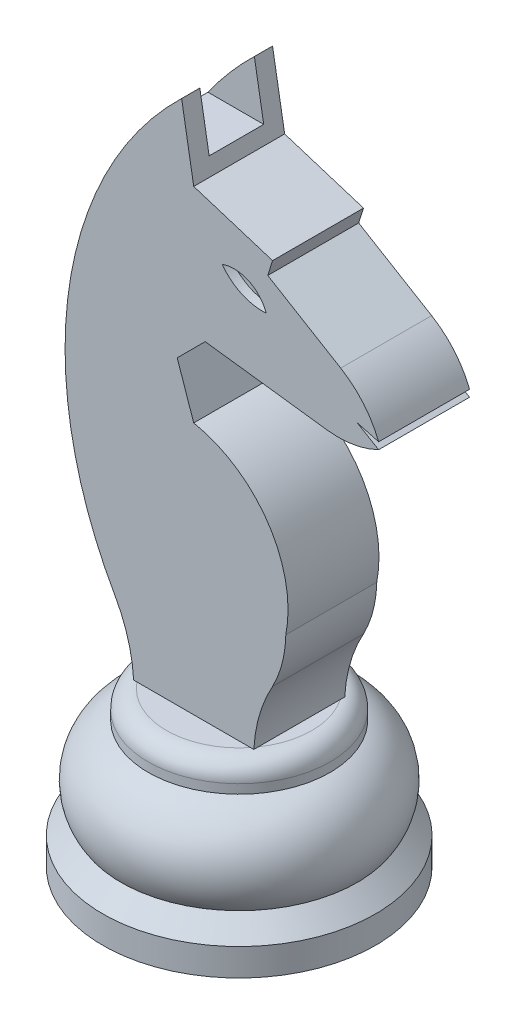
ISO-10303-21;
HEADER;
FILE_DESCRIPTION(('STEP AP214'),'2;1');
FILE_NAME('part.step','',(''),(''),'','','');
FILE_SCHEMA(('AUTOMOTIVE_DESIGN { 1 0 10303 214 1 1 1 1 }'));
ENDSEC;
DATA;
#1=APPLICATION_CONTEXT('core data for automotive mechanical design processes');
#2=APPLICATION_PROTOCOL_DEFINITION('international standard','automotive_design',2000,#1);
#3=PRODUCT_CONTEXT('',#1,'mechanical');
#4=PRODUCT('Part','Part','',(#3));
#5=PRODUCT_RELATED_PRODUCT_CATEGORY('part','',(#4));
#6=PRODUCT_DEFINITION_FORMATION('','',#4);
#7=PRODUCT_DEFINITION_CONTEXT('part definition',#1,'design');
#8=PRODUCT_DEFINITION('design','',#6,#7);
#9=PRODUCT_DEFINITION_SHAPE('','',#8);
#10=(LENGTH_UNIT() NAMED_UNIT(*) SI_UNIT(.MILLI.,.METRE.));
#11=(NAMED_UNIT(*) PLANE_ANGLE_UNIT() SI_UNIT($,.RADIAN.));
#12=(NAMED_UNIT(*) SI_UNIT($,.STERADIAN.) SOLID_ANGLE_UNIT());
#13=UNCERTAINTY_MEASURE_WITH_UNIT(LENGTH_MEASURE(1.E-05),#10,'distance_accuracy_value','');
#14=(GEOMETRIC_REPRESENTATION_CONTEXT(3) GLOBAL_UNCERTAINTY_ASSIGNED_CONTEXT((#13)) GLOBAL_UNIT_ASSIGNED_CONTEXT((#10,
#11,#12)) REPRESENTATION_CONTEXT('',''));
#15=CARTESIAN_POINT('',(0.,0.,0.));
#16=DIRECTION('',(0.,0.,1.));
#17=DIRECTION('',(1.,0.,0.));
#18=AXIS2_PLACEMENT_3D('',#15,#16,#17);
#19=CARTESIAN_POINT('',(4.43651571103369,57.8901281671825,-15.));
#20=DIRECTION('',(0.,0.,1.));
#21=DIRECTION('',(1.,0.,0.));
#22=AXIS2_PLACEMENT_3D('',#19,#20,#21);
#23=CYLINDRICAL_SURFACE('',#22,3.78177275041016);
#24=DIRECTION('',(0.,0.,1.));
#25=VECTOR('',#24,1.);
#26=CARTESIAN_POINT('',(3.12368994317213,61.4367171818533,-15.));
#27=LINE('',#26,#25);
#28=CARTESIAN_POINT('',(3.12368994317213,61.4367171818533,4.));
#29=VERTEX_POINT('',#28);
#30=CARTESIAN_POINT('',(3.12368994317213,61.4367171818533,5.));
#31=VERTEX_POINT('',#30);
#32=EDGE_CURVE('E231',#29,#31,#27,.T.);
#33=ORIENTED_EDGE('',*,*,#32,.F.);
#34=CARTESIAN_POINT('',(4.43651571103369,57.8901281671825,4.));
#35=DIRECTION('',(0.,0.,1.));
#36=DIRECTION('',(-1.,0.,0.));
#37=AXIS2_PLACEMENT_3D('',#34,#35,#36);
#38=CIRCLE('',#37,3.78177275041016);
#39=CARTESIAN_POINT('',(7.98310472570447,59.2029539350441,4.));
#40=VERTEX_POINT('',#39);
#41=EDGE_CURVE('E230',#40,#29,#38,.T.);
#42=ORIENTED_EDGE('',*,*,#41,.F.);
#43=DIRECTION('',(0.,0.,1.));
#44=VECTOR('',#43,1.);
#45=CARTESIAN_POINT('',(7.98310472570447,59.2029539350441,-15.));
#46=LINE('',#45,#44);
#47=CARTESIAN_POINT('',(7.98310472570447,59.2029539350441,5.));
#48=VERTEX_POINT('',#47);
#49=EDGE_CURVE('E218',#40,#48,#46,.T.);
#50=ORIENTED_EDGE('',*,*,#49,.T.);
#51=CARTESIAN_POINT('',(4.43651571103369,57.8901281671825,5.));
#52=DIRECTION('',(0.,0.,1.));
#53=DIRECTION('',(1.,0.,0.));
#54=AXIS2_PLACEMENT_3D('',#51,#52,#53);
#55=CIRCLE('',#54,3.78177275041016);
#56=EDGE_CURVE('E244',#31,#48,#55,.F.);
#57=ORIENTED_EDGE('',*,*,#56,.F.);
#58=EDGE_LOOP('',(#33,#42,#50,#57));
#59=FACE_BOUND('',#58,.T.);
#60=ADVANCED_FACE('F35',(#59),#23,.F.);
#61=CARTESIAN_POINT('',(7.57198155288518,64.7111415775261,-15.));
#62=DIRECTION('',(0.,0.,1.));
#63=DIRECTION('',(1.,0.,0.));
#64=AXIS2_PLACEMENT_3D('',#61,#62,#63);
#65=CYLINDRICAL_SURFACE('',#64,5.52350915342962);
#66=CARTESIAN_POINT('',(7.57198155288518,64.7111415775261,4.));
#67=DIRECTION('',(0.,0.,1.));
#68=DIRECTION('',(1.,0.,0.));
#69=AXIS2_PLACEMENT_3D('',#66,#67,#68);
#70=CIRCLE('',#69,5.52350915342962);
#71=EDGE_CURVE('E50',#29,#40,#70,.T.);
#72=ORIENTED_EDGE('',*,*,#71,.F.);
#73=ORIENTED_EDGE('',*,*,#32,.T.);
#74=CARTESIAN_POINT('',(7.57198155288518,64.7111415775261,5.));
#75=DIRECTION('',(0.,0.,1.));
#76=DIRECTION('',(1.,0.,0.));
#77=AXIS2_PLACEMENT_3D('',#74,#75,#76);
#78=CIRCLE('',#77,5.52350915342962);
#79=EDGE_CURVE('E222',#31,#48,#78,.T.);
#80=ORIENTED_EDGE('',*,*,#79,.T.);
#81=ORIENTED_EDGE('',*,*,#49,.F.);
#82=EDGE_LOOP('',(#72,#73,#80,#81));
#83=FACE_BOUND('',#82,.T.);
#84=ADVANCED_FACE('F220',(#83),#65,.F.);
#85=CARTESIAN_POINT('',(0.,0.,5.));
#86=DIRECTION('',(0.,0.,1.));
#87=DIRECTION('',(1.,0.,0.));
#88=AXIS2_PLACEMENT_3D('',#85,#86,#87);
#89=PLANE('',#88);
#90=DIRECTION('',(-0.991958942438049,0.126560090538789,0.));
#91=VECTOR('',#90,1.);
#92=CARTESIAN_POINT('',(6.69102156361822,52.4432200215809,5.));
#93=LINE('',#92,#91);
#94=CARTESIAN_POINT('',(14.6435990620269,51.4285823333096,5.));
#95=VERTEX_POINT('',#94);
#96=CARTESIAN_POINT('',(1.26040929507154,53.1360902110456,5.));
#97=VERTEX_POINT('',#96);
#98=EDGE_CURVE('E272',#95,#97,#93,.T.);
#99=ORIENTED_EDGE('',*,*,#98,.F.);
#100=CARTESIAN_POINT('',(15.9091999674148,61.3481717576901,5.));
#101=DIRECTION('',(0.,0.,1.));
#102=DIRECTION('',(1.,0.,0.));
#103=AXIS2_PLACEMENT_3D('',#100,#101,#102);
#104=CIRCLE('',#103,10.);
#105=CARTESIAN_POINT('',(20.3370279191774,52.3818826908805,5.));
#106=VERTEX_POINT('',#105);
#107=EDGE_CURVE('E433',#95,#106,#104,.T.);
#108=ORIENTED_EDGE('',*,*,#107,.T.);
#109=DIRECTION('',(-0.860824825124641,0.50890138578032,0.));
#110=VECTOR('',#109,1.);
#111=CARTESIAN_POINT('',(28.2140865617877,47.725132627339,5.));
#112=LINE('',#111,#110);
#113=CARTESIAN_POINT('',(17.9833626558282,53.7733196931858,5.));
#114=VERTEX_POINT('',#113);
#115=EDGE_CURVE('E274',#106,#114,#112,.T.);
#116=ORIENTED_EDGE('',*,*,#115,.T.);
#117=DIRECTION('',(0.965249291729238,-0.261330834032657,0.));
#118=VECTOR('',#117,1.);
#119=CARTESIAN_POINT('',(14.7924400198933,54.6372275778408,5.));
#120=LINE('',#119,#118);
#121=CARTESIAN_POINT('',(20.3370279191774,53.1360902110456,5.));
#122=VERTEX_POINT('',#121);
#123=EDGE_CURVE('E276',#114,#122,#120,.T.);
#124=ORIENTED_EDGE('',*,*,#123,.T.);
#125=CARTESIAN_POINT('',(11.0241641971547,49.4932109521303,5.));
#126=DIRECTION('',(0.,0.,1.));
#127=DIRECTION('',(1.,0.,0.));
#128=AXIS2_PLACEMENT_3D('',#125,#126,#127);
#129=CIRCLE('',#128,10.);
#130=CARTESIAN_POINT('',(16.1651834933892,58.0705019344712,5.));
#131=VERTEX_POINT('',#130);
#132=EDGE_CURVE('E427',#122,#131,#129,.T.);
#133=ORIENTED_EDGE('',*,*,#132,.T.);
#134=DIRECTION('',(0.85772909823408,-0.514101929623448,0.));
#135=VECTOR('',#134,1.);
#136=CARTESIAN_POINT('',(29.8792500799647,49.8506244584026,5.));
#137=LINE('',#136,#135);
#138=CARTESIAN_POINT('',(8.14100346020761,62.88,5.));
#139=VERTEX_POINT('',#138);
#140=EDGE_CURVE('E278',#139,#131,#137,.T.);
#141=ORIENTED_EDGE('',*,*,#140,.F.);
#142=DIRECTION('',(-0.300341483027029,-0.953831742800126,0.));
#143=VECTOR('',#142,1.);
#144=CARTESIAN_POINT('',(-10.606918912442,3.33989488246443,5.));
#145=LINE('',#144,#143);
#146=CARTESIAN_POINT('',(8.67,64.56,5.));
#147=VERTEX_POINT('',#146);
#148=EDGE_CURVE('E281',#147,#139,#145,.T.);
#149=ORIENTED_EDGE('',*,*,#148,.F.);
#150=DIRECTION('',(0.953831742800126,-0.300341483027029,0.));
#151=VECTOR('',#150,1.);
#152=CARTESIAN_POINT('',(19.276918912442,61.2201051175356,5.));
#153=LINE('',#152,#151);
#154=CARTESIAN_POINT('',(0.,67.29,5.));
#155=VERTEX_POINT('',#154);
#156=EDGE_CURVE('E284',#155,#147,#153,.T.);
#157=ORIENTED_EDGE('',*,*,#156,.F.);
#158=DIRECTION('',(-0.169992518725547,0.985445352912755,0.));
#159=VECTOR('',#158,1.);
#160=CARTESIAN_POINT('',(11.272308937644,1.94450984268048,5.));
#161=LINE('',#160,#159);
#162=CARTESIAN_POINT('',(-1.33,75.,5.));
#163=VERTEX_POINT('',#162);
#164=EDGE_CURVE('E287',#155,#163,#161,.T.);
#165=ORIENTED_EDGE('',*,*,#164,.T.);
#166=CARTESIAN_POINT('',(27.9235426116549,44.765662820758,5.));
#167=DIRECTION('',(0.,0.,1.));
#168=DIRECTION('',(1.,0.,0.));
#169=AXIS2_PLACEMENT_3D('',#166,#167,#168);
#170=CIRCLE('',#169,42.07);
#171=CARTESIAN_POINT('',(-8.67,24.01,5.));
#172=VERTEX_POINT('',#171);
#173=EDGE_CURVE('E289',#172,#163,#170,.F.);
#174=ORIENTED_EDGE('',*,*,#173,.F.);
#175=CARTESIAN_POINT('',(-22.6660755194939,16.0931654019663,5.));
#176=DIRECTION('',(0.,0.,1.));
#177=DIRECTION('',(1.,0.,0.));
#178=AXIS2_PLACEMENT_3D('',#175,#176,#177);
#179=CIRCLE('',#178,16.08);
#180=CARTESIAN_POINT('',(-6.61,16.97,5.));
#181=VERTEX_POINT('',#180);
#182=EDGE_CURVE('E292',#181,#172,#179,.T.);
#183=ORIENTED_EDGE('',*,*,#182,.F.);
#184=DIRECTION('',(1.,0.,0.));
#185=VECTOR('',#184,1.);
#186=CARTESIAN_POINT('',(0.,16.97,5.));
#187=LINE('',#186,#185);
#188=CARTESIAN_POINT('',(-6.2449979983984,16.97,5.));
#189=VERTEX_POINT('',#188);
#190=EDGE_CURVE('E296',#181,#189,#187,.T.);
#191=ORIENTED_EDGE('',*,*,#190,.T.);
#192=DIRECTION('',(-1.,0.,0.));
#193=VECTOR('',#192,1.);
#194=CARTESIAN_POINT('',(0.,16.97,5.));
#195=LINE('',#194,#193);
#196=CARTESIAN_POINT('',(6.2449979983984,16.97,5.));
#197=VERTEX_POINT('',#196);
#198=EDGE_CURVE('E408',#197,#189,#195,.T.);
#199=ORIENTED_EDGE('',*,*,#198,.F.);
#200=CARTESIAN_POINT('',(6.61,16.97,5.));
#201=VERTEX_POINT('',#200);
#202=EDGE_CURVE('E295',#197,#201,#187,.T.);
#203=ORIENTED_EDGE('',*,*,#202,.T.);
#204=CARTESIAN_POINT('',(22.6660755194939,16.0931654019663,5.));
#205=DIRECTION('',(0.,0.,1.));
#206=DIRECTION('',(1.,0.,0.));
#207=AXIS2_PLACEMENT_3D('',#204,#205,#206);
#208=CIRCLE('',#207,16.08);
#209=CARTESIAN_POINT('',(8.67,24.01,5.));
#210=VERTEX_POINT('',#209);
#211=EDGE_CURVE('E299',#201,#210,#208,.F.);
#212=ORIENTED_EDGE('',*,*,#211,.T.);
#213=CARTESIAN_POINT('',(-2.54706769196138,29.9226806436638,5.));
#214=DIRECTION('',(0.,0.,1.));
#215=DIRECTION('',(1.,0.,0.));
#216=AXIS2_PLACEMENT_3D('',#213,#214,#215);
#217=CIRCLE('',#216,12.68);
#218=CARTESIAN_POINT('',(10.13,29.65,5.));
#219=VERTEX_POINT('',#218);
#220=EDGE_CURVE('E301',#210,#219,#217,.T.);
#221=ORIENTED_EDGE('',*,*,#220,.T.);
#222=CARTESIAN_POINT('',(-2.49283141037903,32.142831410379,5.));
#223=DIRECTION('',(0.,0.,1.));
#224=DIRECTION('',(1.,0.,0.));
#225=AXIS2_PLACEMENT_3D('',#222,#223,#224);
#226=CIRCLE('',#225,12.8666266463057);
#227=CARTESIAN_POINT('',(0.,44.765662820758,5.));
#228=VERTEX_POINT('',#227);
#229=EDGE_CURVE('E262',#228,#219,#226,.F.);
#230=ORIENTED_EDGE('',*,*,#229,.F.);
#231=DIRECTION('',(0.32451587239111,-0.945880250648166,0.));
#232=VECTOR('',#231,1.);
#233=CARTESIAN_POINT('',(13.7409614258118,4.71429663695194,5.));
#234=LINE('',#233,#232);
#235=CARTESIAN_POINT('',(-1.81621596842221,50.0594649475518,5.));
#236=VERTEX_POINT('',#235);
#237=EDGE_CURVE('E265',#236,#228,#234,.T.);
#238=ORIENTED_EDGE('',*,*,#237,.F.);
#239=DIRECTION('',(-0.707106781186542,-0.707106781186553,0.));
#240=VECTOR('',#239,1.);
#241=CARTESIAN_POINT('',(-25.937840457987,25.9378404579866,5.));
#242=LINE('',#241,#240);
#243=EDGE_CURVE('E269',#97,#236,#242,.T.);
#244=ORIENTED_EDGE('',*,*,#243,.F.);
#245=EDGE_LOOP('',(#99,#108,#116,#124,#133,#141,#149,#157,#165,#174,#183,#191,#199,#203,#212,
#221,#230,#238,#244));
#246=FACE_BOUND('',#245,.T.);
#247=ORIENTED_EDGE('',*,*,#79,.F.);
#248=ORIENTED_EDGE('',*,*,#56,.T.);
#249=EDGE_LOOP('',(#247,#248));
#250=FACE_BOUND('',#249,.T.);
#251=ADVANCED_FACE('F458',(#246,#250),#89,.T.);
#252=CARTESIAN_POINT('',(0.,0.,-5.));
#253=DIRECTION('',(0.,0.,1.));
#254=DIRECTION('',(1.,0.,0.));
#255=AXIS2_PLACEMENT_3D('',#252,#253,#254);
#256=PLANE('',#255);
#257=DIRECTION('',(-0.860824825124641,0.50890138578032,0.));
#258=VECTOR('',#257,1.);
#259=CARTESIAN_POINT('',(28.2140865617877,47.725132627339,-5.));
#260=LINE('',#259,#258);
#261=CARTESIAN_POINT('',(20.3370279191774,52.3818826908805,-5.));
#262=VERTEX_POINT('',#261);
#263=CARTESIAN_POINT('',(17.9833626558282,53.7733196931858,-5.));
#264=VERTEX_POINT('',#263);
#265=EDGE_CURVE('E314',#262,#264,#260,.T.);
#266=ORIENTED_EDGE('',*,*,#265,.F.);
#267=CARTESIAN_POINT('',(15.9091999674148,61.3481717576901,-5.));
#268=DIRECTION('',(0.,0.,1.));
#269=DIRECTION('',(1.,0.,0.));
#270=AXIS2_PLACEMENT_3D('',#267,#268,#269);
#271=CIRCLE('',#270,10.);
#272=CARTESIAN_POINT('',(14.6435990620269,51.4285823333096,-5.));
#273=VERTEX_POINT('',#272);
#274=EDGE_CURVE('E429',#262,#273,#271,.F.);
#275=ORIENTED_EDGE('',*,*,#274,.T.);
#276=DIRECTION('',(-0.991958942438049,0.126560090538789,0.));
#277=VECTOR('',#276,1.);
#278=CARTESIAN_POINT('',(6.69102156361822,52.4432200215809,-5.));
#279=LINE('',#278,#277);
#280=CARTESIAN_POINT('',(1.26040929507154,53.1360902110456,-5.));
#281=VERTEX_POINT('',#280);
#282=EDGE_CURVE('E312',#273,#281,#279,.T.);
#283=ORIENTED_EDGE('',*,*,#282,.T.);
#284=DIRECTION('',(-0.707106781186542,-0.707106781186553,0.));
#285=VECTOR('',#284,1.);
#286=CARTESIAN_POINT('',(-25.937840457987,25.9378404579866,-5.));
#287=LINE('',#286,#285);
#288=CARTESIAN_POINT('',(-1.81621596842221,50.0594649475518,-5.));
#289=VERTEX_POINT('',#288);
#290=EDGE_CURVE('E309',#281,#289,#287,.T.);
#291=ORIENTED_EDGE('',*,*,#290,.T.);
#292=DIRECTION('',(0.32451587239111,-0.945880250648166,0.));
#293=VECTOR('',#292,1.);
#294=CARTESIAN_POINT('',(13.7409614258118,4.71429663695194,-5.));
#295=LINE('',#294,#293);
#296=CARTESIAN_POINT('',(0.,44.765662820758,-5.));
#297=VERTEX_POINT('',#296);
#298=EDGE_CURVE('E306',#289,#297,#295,.T.);
#299=ORIENTED_EDGE('',*,*,#298,.T.);
#300=CARTESIAN_POINT('',(-2.49283141037903,32.142831410379,-5.));
#301=DIRECTION('',(0.,0.,1.));
#302=DIRECTION('',(1.,0.,0.));
#303=AXIS2_PLACEMENT_3D('',#300,#301,#302);
#304=CIRCLE('',#303,12.8666266463057);
#305=CARTESIAN_POINT('',(10.13,29.65,-5.));
#306=VERTEX_POINT('',#305);
#307=EDGE_CURVE('E261',#297,#306,#304,.F.);
#308=ORIENTED_EDGE('',*,*,#307,.T.);
#309=CARTESIAN_POINT('',(-2.54706769196138,29.9226806436638,-5.));
#310=DIRECTION('',(0.,0.,1.));
#311=DIRECTION('',(1.,0.,0.));
#312=AXIS2_PLACEMENT_3D('',#309,#310,#311);
#313=CIRCLE('',#312,12.68);
#314=CARTESIAN_POINT('',(8.67,24.01,-5.));
#315=VERTEX_POINT('',#314);
#316=EDGE_CURVE('E266',#315,#306,#313,.T.);
#317=ORIENTED_EDGE('',*,*,#316,.F.);
#318=CARTESIAN_POINT('',(22.6660755194939,16.0931654019663,-5.));
#319=DIRECTION('',(0.,0.,1.));
#320=DIRECTION('',(1.,0.,0.));
#321=AXIS2_PLACEMENT_3D('',#318,#319,#320);
#322=CIRCLE('',#321,16.08);
#323=CARTESIAN_POINT('',(6.61,16.97,-5.));
#324=VERTEX_POINT('',#323);
#325=EDGE_CURVE('E341',#324,#315,#322,.F.);
#326=ORIENTED_EDGE('',*,*,#325,.F.);
#327=DIRECTION('',(1.,0.,0.));
#328=VECTOR('',#327,1.);
#329=CARTESIAN_POINT('',(0.,16.97,-5.));
#330=LINE('',#329,#328);
#331=CARTESIAN_POINT('',(6.2449979983984,16.97,-5.));
#332=VERTEX_POINT('',#331);
#333=EDGE_CURVE('E337',#332,#324,#330,.T.);
#334=ORIENTED_EDGE('',*,*,#333,.F.);
#335=DIRECTION('',(-1.,0.,0.));
#336=VECTOR('',#335,1.);
#337=CARTESIAN_POINT('',(0.,16.97,-5.));
#338=LINE('',#337,#336);
#339=CARTESIAN_POINT('',(-6.2449979983984,16.97,-5.));
#340=VERTEX_POINT('',#339);
#341=EDGE_CURVE('E405',#332,#340,#338,.T.);
#342=ORIENTED_EDGE('',*,*,#341,.T.);
#343=CARTESIAN_POINT('',(-6.61,16.97,-5.));
#344=VERTEX_POINT('',#343);
#345=EDGE_CURVE('E338',#344,#340,#330,.T.);
#346=ORIENTED_EDGE('',*,*,#345,.F.);
#347=CARTESIAN_POINT('',(-22.6660755194939,16.0931654019663,-5.));
#348=DIRECTION('',(0.,0.,1.));
#349=DIRECTION('',(1.,0.,0.));
#350=AXIS2_PLACEMENT_3D('',#347,#348,#349);
#351=CIRCLE('',#350,16.08);
#352=CARTESIAN_POINT('',(-8.67,24.01,-5.));
#353=VERTEX_POINT('',#352);
#354=EDGE_CURVE('E334',#344,#353,#351,.T.);
#355=ORIENTED_EDGE('',*,*,#354,.T.);
#356=CARTESIAN_POINT('',(27.9235426116549,44.765662820758,-5.));
#357=DIRECTION('',(0.,0.,1.));
#358=DIRECTION('',(1.,0.,0.));
#359=AXIS2_PLACEMENT_3D('',#356,#357,#358);
#360=CIRCLE('',#359,42.07);
#361=CARTESIAN_POINT('',(-1.33,75.,-5.));
#362=VERTEX_POINT('',#361);
#363=EDGE_CURVE('E331',#353,#362,#360,.F.);
#364=ORIENTED_EDGE('',*,*,#363,.T.);
#365=DIRECTION('',(-0.169992518725547,0.985445352912755,0.));
#366=VECTOR('',#365,1.);
#367=CARTESIAN_POINT('',(11.272308937644,1.94450984268048,-5.));
#368=LINE('',#367,#366);
#369=CARTESIAN_POINT('',(0.,67.29,-5.));
#370=VERTEX_POINT('',#369);
#371=EDGE_CURVE('E328',#370,#362,#368,.T.);
#372=ORIENTED_EDGE('',*,*,#371,.F.);
#373=DIRECTION('',(0.953831742800126,-0.300341483027029,0.));
#374=VECTOR('',#373,1.);
#375=CARTESIAN_POINT('',(19.276918912442,61.2201051175356,-5.));
#376=LINE('',#375,#374);
#377=CARTESIAN_POINT('',(8.67,64.56,-5.));
#378=VERTEX_POINT('',#377);
#379=EDGE_CURVE('E325',#370,#378,#376,.T.);
#380=ORIENTED_EDGE('',*,*,#379,.T.);
#381=DIRECTION('',(-0.300341483027029,-0.953831742800126,0.));
#382=VECTOR('',#381,1.);
#383=CARTESIAN_POINT('',(-10.606918912442,3.33989488246443,-5.));
#384=LINE('',#383,#382);
#385=CARTESIAN_POINT('',(8.14100346020761,62.88,-5.));
#386=VERTEX_POINT('',#385);
#387=EDGE_CURVE('E322',#378,#386,#384,.T.);
#388=ORIENTED_EDGE('',*,*,#387,.T.);
#389=DIRECTION('',(0.85772909823408,-0.514101929623448,0.));
#390=VECTOR('',#389,1.);
#391=CARTESIAN_POINT('',(29.8792500799647,49.8506244584026,-5.));
#392=LINE('',#391,#390);
#393=CARTESIAN_POINT('',(16.1651834933892,58.0705019344712,-5.));
#394=VERTEX_POINT('',#393);
#395=EDGE_CURVE('E319',#386,#394,#392,.T.);
#396=ORIENTED_EDGE('',*,*,#395,.T.);
#397=CARTESIAN_POINT('',(11.0241641971547,49.4932109521303,-5.));
#398=DIRECTION('',(0.,0.,1.));
#399=DIRECTION('',(1.,0.,0.));
#400=AXIS2_PLACEMENT_3D('',#397,#398,#399);
#401=CIRCLE('',#400,10.);
#402=CARTESIAN_POINT('',(20.3370279191774,53.1360902110456,-5.));
#403=VERTEX_POINT('',#402);
#404=EDGE_CURVE('E425',#394,#403,#401,.F.);
#405=ORIENTED_EDGE('',*,*,#404,.T.);
#406=DIRECTION('',(0.965249291729238,-0.261330834032657,0.));
#407=VECTOR('',#406,1.);
#408=CARTESIAN_POINT('',(14.7924400198933,54.6372275778408,-5.));
#409=LINE('',#408,#407);
#410=EDGE_CURVE('E316',#264,#403,#409,.T.);
#411=ORIENTED_EDGE('',*,*,#410,.F.);
#412=EDGE_LOOP('',(#266,#275,#283,#291,#299,#308,#317,#326,#334,#342,#346,#355,#364,#372,#380,
#388,#396,#405,#411));
#413=FACE_BOUND('',#412,.T.);
#414=CARTESIAN_POINT('',(4.43651571103369,57.8901281671825,-5.));
#415=DIRECTION('',(0.,0.,1.));
#416=DIRECTION('',(1.,0.,0.));
#417=AXIS2_PLACEMENT_3D('',#414,#415,#416);
#418=CIRCLE('',#417,3.78177275041016);
#419=CARTESIAN_POINT('',(3.12368994317213,61.4367171818533,-5.));
#420=VERTEX_POINT('',#419);
#421=CARTESIAN_POINT('',(7.98310472570447,59.2029539350441,-5.));
#422=VERTEX_POINT('',#421);
#423=EDGE_CURVE('E11',#420,#422,#418,.F.);
#424=ORIENTED_EDGE('',*,*,#423,.F.);
#425=CARTESIAN_POINT('',(7.57198155288518,64.7111415775261,-5.));
#426=DIRECTION('',(0.,0.,1.));
#427=DIRECTION('',(1.,0.,0.));
#428=AXIS2_PLACEMENT_3D('',#425,#426,#427);
#429=CIRCLE('',#428,5.52350915342962);
#430=EDGE_CURVE('E43',#420,#422,#429,.T.);
#431=ORIENTED_EDGE('',*,*,#430,.T.);
#432=EDGE_LOOP('',(#424,#431));
#433=FACE_BOUND('',#432,.T.);
#434=ADVANCED_FACE('F437',(#413,#433),#256,.F.);
#435=CARTESIAN_POINT('',(0.,16.97,0.));
#436=DIRECTION('',(0.,-1.,0.));
#437=DIRECTION('',(0.,0.,-1.));
#438=AXIS2_PLACEMENT_3D('',#435,#436,#437);
#439=PLANE('',#438);
#440=DIRECTION('',(0.,0.,-1.));
#441=VECTOR('',#440,1.);
#442=CARTESIAN_POINT('',(6.61,16.97,5.));
#443=LINE('',#442,#441);
#444=CARTESIAN_POINT('',(6.61,16.97,4.50642874125399));
#445=VERTEX_POINT('',#444);
#446=CARTESIAN_POINT('',(6.61,16.97,-4.50642874125399));
#447=VERTEX_POINT('',#446);
#448=EDGE_CURVE('E410',#445,#447,#443,.T.);
#449=ORIENTED_EDGE('',*,*,#448,.F.);
#450=CARTESIAN_POINT('',(0.,16.97,0.));
#451=DIRECTION('',(0.,-1.,0.));
#452=DIRECTION('',(0.,0.,-1.));
#453=AXIS2_PLACEMENT_3D('',#450,#451,#452);
#454=CIRCLE('',#453,8.);
#455=EDGE_CURVE('E390',#447,#445,#454,.T.);
#456=ORIENTED_EDGE('',*,*,#455,.F.);
#457=EDGE_LOOP('',(#449,#456));
#458=FACE_BOUND('',#457,.T.);
#459=ADVANCED_FACE('F500',(#458),#439,.F.);
#460=CARTESIAN_POINT('',(-6.61,16.97,4.50642874125399));
#461=VERTEX_POINT('',#460);
#462=CARTESIAN_POINT('',(-6.61,16.97,-4.50642874125399));
#463=VERTEX_POINT('',#462);
#464=EDGE_CURVE('E863',#461,#463,#454,.T.);
#465=ORIENTED_EDGE('',*,*,#464,.F.);
#466=DIRECTION('',(0.,0.,-1.));
#467=VECTOR('',#466,1.);
#468=CARTESIAN_POINT('',(-6.61,16.97,5.));
#469=LINE('',#468,#467);
#470=EDGE_CURVE('E413',#461,#463,#469,.T.);
#471=ORIENTED_EDGE('',*,*,#470,.T.);
#472=EDGE_LOOP('',(#465,#471));
#473=FACE_BOUND('',#472,.T.);
#474=ADVANCED_FACE('F765',(#473),#439,.F.);
#475=ORIENTED_EDGE('',*,*,#341,.F.);
#476=EDGE_CURVE('E385',#340,#332,#454,.T.);
#477=ORIENTED_EDGE('',*,*,#476,.F.);
#478=EDGE_LOOP('',(#475,#477));
#479=FACE_BOUND('',#478,.T.);
#480=ADVANCED_FACE('F742',(#479),#439,.F.);
#481=CARTESIAN_POINT('',(0.,14.97,0.));
#482=DIRECTION('',(0.,-1.,0.));
#483=DIRECTION('',(0.,0.,-1.));
#484=AXIS2_PLACEMENT_3D('',#481,#482,#483);
#485=TOROIDAL_SURFACE('',#484,7.99999999999999,2.00000000000001);
#486=EDGE_CURVE('E386',#332,#447,#454,.T.);
#487=ORIENTED_EDGE('',*,*,#486,.T.);
#488=ORIENTED_EDGE('',*,*,#455,.T.);
#489=EDGE_CURVE('E841',#445,#197,#454,.T.);
#490=ORIENTED_EDGE('',*,*,#489,.T.);
#491=EDGE_CURVE('E849',#197,#189,#454,.T.);
#492=ORIENTED_EDGE('',*,*,#491,.T.);
#493=EDGE_CURVE('E861',#189,#461,#454,.T.);
#494=ORIENTED_EDGE('',*,*,#493,.T.);
#495=ORIENTED_EDGE('',*,*,#464,.T.);
#496=EDGE_CURVE('E864',#463,#340,#454,.T.);
#497=ORIENTED_EDGE('',*,*,#496,.T.);
#498=ORIENTED_EDGE('',*,*,#476,.T.);
#499=EDGE_LOOP('',(#487,#488,#490,#492,#494,#495,#497,#498));
#500=FACE_BOUND('',#499,.T.);
#501=CARTESIAN_POINT('',(0.,14.97,0.));
#502=DIRECTION('',(0.,-1.,0.));
#503=DIRECTION('',(0.,0.,-1.));
#504=AXIS2_PLACEMENT_3D('',#501,#502,#503);
#505=CIRCLE('',#504,10.);
#506=CARTESIAN_POINT('',(0.,14.97,-10.));
#507=VERTEX_POINT('',#506);
#508=EDGE_CURVE('E402',#507,#507,#505,.T.);
#509=ORIENTED_EDGE('',*,*,#508,.F.);
#510=EDGE_LOOP('',(#509));
#511=FACE_BOUND('',#510,.T.);
#512=ADVANCED_FACE('F749',(#500,#511),#485,.T.);
#513=CARTESIAN_POINT('',(0.,5.,0.));
#514=DIRECTION('',(0.,-1.,0.));
#515=DIRECTION('',(0.,0.,-1.));
#516=AXIS2_PLACEMENT_3D('',#513,#514,#515);
#517=CYLINDRICAL_SURFACE('',#516,10.);
#518=ORIENTED_EDGE('',*,*,#508,.T.);
#519=EDGE_LOOP('',(#518));
#520=FACE_BOUND('',#519,.T.);
#521=CARTESIAN_POINT('',(0.,13.97,0.));
#522=DIRECTION('',(0.,-1.,0.));
#523=DIRECTION('',(0.,0.,-1.));
#524=AXIS2_PLACEMENT_3D('',#521,#522,#523);
#525=CIRCLE('',#524,10.);
#526=CARTESIAN_POINT('',(0.,13.97,-10.));
#527=VERTEX_POINT('',#526);
#528=EDGE_CURVE('E399',#527,#527,#525,.T.);
#529=ORIENTED_EDGE('',*,*,#528,.F.);
#530=EDGE_LOOP('',(#529));
#531=FACE_BOUND('',#530,.T.);
#532=ADVANCED_FACE('F754',(#520,#531),#517,.T.);
#533=CARTESIAN_POINT('',(0.,8.31380661428567,0.));
#534=DIRECTION('',(0.,-1.,0.));
#535=DIRECTION('',(0.,0.,-1.));
#536=AXIS2_PLACEMENT_3D('',#533,#534,#535);
#537=TOROIDAL_SURFACE('',#536,7.99813177671417,6.);
#538=ORIENTED_EDGE('',*,*,#528,.T.);
#539=EDGE_LOOP('',(#538));
#540=FACE_BOUND('',#539,.T.);
#541=CARTESIAN_POINT('',(0.,5.,0.));
#542=DIRECTION('',(0.,-1.,0.));
#543=DIRECTION('',(0.,0.,-1.));
#544=AXIS2_PLACEMENT_3D('',#541,#542,#543);
#545=CIRCLE('',#544,13.);
#546=CARTESIAN_POINT('',(0.,5.,-13.));
#547=VERTEX_POINT('',#546);
#548=EDGE_CURVE('E396',#547,#547,#545,.T.);
#549=ORIENTED_EDGE('',*,*,#548,.F.);
#550=EDGE_LOOP('',(#549));
#551=FACE_BOUND('',#550,.T.);
#552=ADVANCED_FACE('F806',(#540,#551),#537,.T.);
#553=CARTESIAN_POINT('',(0.,5.,0.));
#554=DIRECTION('',(0.,-1.,0.));
#555=DIRECTION('',(0.,0.,-1.));
#556=AXIS2_PLACEMENT_3D('',#553,#554,#555);
#557=CONICAL_SURFACE('',#556,13.,0.785398163397449);
#558=CARTESIAN_POINT('',(0.,3.,0.));
#559=DIRECTION('',(0.,-1.,0.));
#560=DIRECTION('',(0.,0.,-1.));
#561=AXIS2_PLACEMENT_3D('',#558,#559,#560);
#562=CIRCLE('',#561,15.);
#563=CARTESIAN_POINT('',(0.,3.,-15.));
#564=VERTEX_POINT('',#563);
#565=EDGE_CURVE('E393',#564,#564,#562,.T.);
#566=ORIENTED_EDGE('',*,*,#565,.F.);
#567=EDGE_LOOP('',(#566));
#568=FACE_BOUND('',#567,.T.);
#569=ORIENTED_EDGE('',*,*,#548,.T.);
#570=EDGE_LOOP('',(#569));
#571=FACE_BOUND('',#570,.T.);
#572=ADVANCED_FACE('F796',(#568,#571),#557,.T.);
#573=CARTESIAN_POINT('',(0.,5.,0.));
#574=DIRECTION('',(0.,-1.,0.));
#575=DIRECTION('',(0.,0.,-1.));
#576=AXIS2_PLACEMENT_3D('',#573,#574,#575);
#577=CYLINDRICAL_SURFACE('',#576,15.);
#578=CARTESIAN_POINT('',(0.,0.,0.));
#579=DIRECTION('',(0.,-1.,0.));
#580=DIRECTION('',(0.,0.,-1.));
#581=AXIS2_PLACEMENT_3D('',#578,#579,#580);
#582=CIRCLE('',#581,15.);
#583=CARTESIAN_POINT('',(0.,0.,-15.));
#584=VERTEX_POINT('',#583);
#585=EDGE_CURVE('E389',#584,#584,#582,.T.);
#586=ORIENTED_EDGE('',*,*,#585,.F.);
#587=EDGE_LOOP('',(#586));
#588=FACE_BOUND('',#587,.T.);
#589=ORIENTED_EDGE('',*,*,#565,.T.);
#590=EDGE_LOOP('',(#589));
#591=FACE_BOUND('',#590,.T.);
#592=ADVANCED_FACE('F786',(#588,#591),#577,.T.);
#593=CARTESIAN_POINT('',(0.,0.,0.));
#594=DIRECTION('',(0.,-1.,0.));
#595=DIRECTION('',(0.,0.,-1.));
#596=AXIS2_PLACEMENT_3D('',#593,#594,#595);
#597=PLANE('',#596);
#598=ORIENTED_EDGE('',*,*,#585,.T.);
#599=EDGE_LOOP('',(#598));
#600=FACE_BOUND('',#599,.T.);
#601=ADVANCED_FACE('F739',(#600),#597,.T.);
#602=ORIENTED_EDGE('',*,*,#491,.F.);
#603=ORIENTED_EDGE('',*,*,#198,.T.);
#604=EDGE_LOOP('',(#602,#603));
#605=FACE_BOUND('',#604,.T.);
#606=ADVANCED_FACE('F729',(#605),#439,.F.);
#607=CARTESIAN_POINT('',(0.,16.97,5.));
#608=DIRECTION('',(0.,1.,0.));
#609=DIRECTION('',(0.,0.,1.));
#610=AXIS2_PLACEMENT_3D('',#607,#608,#609);
#611=PLANE('',#610);
#612=ORIENTED_EDGE('',*,*,#345,.T.);
#613=ORIENTED_EDGE('',*,*,#496,.F.);
#614=DIRECTION('',(0.,0.,-1.));
#615=VECTOR('',#614,1.);
#616=CARTESIAN_POINT('',(-6.61,16.97,5.));
#617=LINE('',#616,#615);
#618=EDGE_CURVE('E353',#463,#344,#617,.T.);
#619=ORIENTED_EDGE('',*,*,#618,.T.);
#620=EDGE_LOOP('',(#612,#613,#619));
#621=FACE_BOUND('',#620,.T.);
#622=ADVANCED_FACE('F654',(#621),#611,.F.);
#623=EDGE_CURVE('E354',#181,#461,#617,.T.);
#624=ORIENTED_EDGE('',*,*,#623,.T.);
#625=ORIENTED_EDGE('',*,*,#493,.F.);
#626=ORIENTED_EDGE('',*,*,#190,.F.);
#627=EDGE_LOOP('',(#624,#625,#626));
#628=FACE_BOUND('',#627,.T.);
#629=ADVANCED_FACE('F712',(#628),#611,.F.);
#630=ORIENTED_EDGE('',*,*,#202,.F.);
#631=ORIENTED_EDGE('',*,*,#489,.F.);
#632=DIRECTION('',(0.,0.,-1.));
#633=VECTOR('',#632,1.);
#634=CARTESIAN_POINT('',(6.61,16.97,5.));
#635=LINE('',#634,#633);
#636=EDGE_CURVE('E350',#201,#445,#635,.T.);
#637=ORIENTED_EDGE('',*,*,#636,.F.);
#638=EDGE_LOOP('',(#630,#631,#637));
#639=FACE_BOUND('',#638,.T.);
#640=ADVANCED_FACE('F655',(#639),#611,.F.);
#641=CARTESIAN_POINT('',(-2.49283141037903,32.142831410379,5.));
#642=DIRECTION('',(0.,0.,-1.));
#643=DIRECTION('',(-1.,0.,0.));
#644=AXIS2_PLACEMENT_3D('',#641,#642,#643);
#645=CYLINDRICAL_SURFACE('',#644,12.8666266463057);
#646=ORIENTED_EDGE('',*,*,#307,.F.);
#647=DIRECTION('',(0.,0.,-1.));
#648=VECTOR('',#647,1.);
#649=CARTESIAN_POINT('',(0.,44.765662820758,5.));
#650=LINE('',#649,#648);
#651=EDGE_CURVE('E383',#228,#297,#650,.T.);
#652=ORIENTED_EDGE('',*,*,#651,.F.);
#653=ORIENTED_EDGE('',*,*,#229,.T.);
#654=DIRECTION('',(0.,0.,-1.));
#655=VECTOR('',#654,1.);
#656=CARTESIAN_POINT('',(10.13,29.65,5.));
#657=LINE('',#656,#655);
#658=EDGE_CURVE('E303',#219,#306,#657,.T.);
#659=ORIENTED_EDGE('',*,*,#658,.T.);
#660=EDGE_LOOP('',(#646,#652,#653,#659));
#661=FACE_BOUND('',#660,.T.);
#662=ADVANCED_FACE('F693',(#661),#645,.T.);
#663=CARTESIAN_POINT('',(13.7409614258118,4.71429663695194,5.));
#664=DIRECTION('',(0.945880250648166,0.32451587239111,0.));
#665=DIRECTION('',(-0.32451587239111,0.945880250648166,0.));
#666=AXIS2_PLACEMENT_3D('',#663,#664,#665);
#667=PLANE('',#666);
#668=ORIENTED_EDGE('',*,*,#298,.F.);
#669=DIRECTION('',(0.,0.,-1.));
#670=VECTOR('',#669,1.);
#671=CARTESIAN_POINT('',(-1.81621596842221,50.0594649475518,5.));
#672=LINE('',#671,#670);
#673=EDGE_CURVE('E381',#236,#289,#672,.T.);
#674=ORIENTED_EDGE('',*,*,#673,.F.);
#675=ORIENTED_EDGE('',*,*,#237,.T.);
#676=ORIENTED_EDGE('',*,*,#651,.T.);
#677=EDGE_LOOP('',(#668,#674,#675,#676));
#678=FACE_BOUND('',#677,.T.);
#679=ADVANCED_FACE('F683',(#678),#667,.T.);
#680=CARTESIAN_POINT('',(-25.937840457987,25.9378404579866,5.));
#681=DIRECTION('',(0.707106781186553,-0.707106781186542,0.));
#682=DIRECTION('',(0.707106781186542,0.707106781186553,0.));
#683=AXIS2_PLACEMENT_3D('',#680,#681,#682);
#684=PLANE('',#683);
#685=ORIENTED_EDGE('',*,*,#290,.F.);
#686=DIRECTION('',(0.,0.,-1.));
#687=VECTOR('',#686,1.);
#688=CARTESIAN_POINT('',(1.26040929507154,53.1360902110456,5.));
#689=LINE('',#688,#687);
#690=EDGE_CURVE('E378',#97,#281,#689,.T.);
#691=ORIENTED_EDGE('',*,*,#690,.F.);
#692=ORIENTED_EDGE('',*,*,#243,.T.);
#693=ORIENTED_EDGE('',*,*,#673,.T.);
#694=EDGE_LOOP('',(#685,#691,#692,#693));
#695=FACE_BOUND('',#694,.T.);
#696=ADVANCED_FACE('F538',(#695),#684,.T.);
#697=CARTESIAN_POINT('',(6.69102156361822,52.4432200215809,5.));
#698=DIRECTION('',(-0.126560090538789,-0.991958942438049,0.));
#699=DIRECTION('',(0.991958942438049,-0.126560090538789,0.));
#700=AXIS2_PLACEMENT_3D('',#697,#698,#699);
#701=PLANE('',#700);
#702=ORIENTED_EDGE('',*,*,#282,.F.);
#703=DIRECTION('',(0.,0.,1.));
#704=VECTOR('',#703,1.);
#705=CARTESIAN_POINT('',(14.6435990620269,51.4285823333096,5.));
#706=LINE('',#705,#704);
#707=EDGE_CURVE('E431',#273,#95,#706,.T.);
#708=ORIENTED_EDGE('',*,*,#707,.T.);
#709=ORIENTED_EDGE('',*,*,#98,.T.);
#710=ORIENTED_EDGE('',*,*,#690,.T.);
#711=EDGE_LOOP('',(#702,#708,#709,#710));
#712=FACE_BOUND('',#711,.T.);
#713=ADVANCED_FACE('F526',(#712),#701,.T.);
#714=CARTESIAN_POINT('',(28.2140865617877,47.725132627339,5.));
#715=DIRECTION('',(-0.50890138578032,-0.860824825124642,0.));
#716=DIRECTION('',(0.860824825124642,-0.50890138578032,0.));
#717=AXIS2_PLACEMENT_3D('',#714,#715,#716);
#718=PLANE('',#717);
#719=ORIENTED_EDGE('',*,*,#265,.T.);
#720=DIRECTION('',(0.,0.,-1.));
#721=VECTOR('',#720,1.);
#722=CARTESIAN_POINT('',(17.9833626558282,53.7733196931858,5.));
#723=LINE('',#722,#721);
#724=EDGE_CURVE('E372',#114,#264,#723,.T.);
#725=ORIENTED_EDGE('',*,*,#724,.F.);
#726=ORIENTED_EDGE('',*,*,#115,.F.);
#727=DIRECTION('',(0.,0.,-1.));
#728=VECTOR('',#727,1.);
#729=CARTESIAN_POINT('',(20.3370279191774,52.3818826908805,5.));
#730=LINE('',#729,#728);
#731=EDGE_CURVE('E375',#106,#262,#730,.T.);
#732=ORIENTED_EDGE('',*,*,#731,.T.);
#733=EDGE_LOOP('',(#719,#725,#726,#732));
#734=FACE_BOUND('',#733,.T.);
#735=ADVANCED_FACE('F520',(#734),#718,.F.);
#736=CARTESIAN_POINT('',(14.7924400198933,54.6372275778408,5.));
#737=DIRECTION('',(0.261330834032657,0.965249291729238,0.));
#738=DIRECTION('',(-0.965249291729238,0.261330834032657,0.));
#739=AXIS2_PLACEMENT_3D('',#736,#737,#738);
#740=PLANE('',#739);
#741=ORIENTED_EDGE('',*,*,#410,.T.);
#742=DIRECTION('',(0.,0.,-1.));
#743=VECTOR('',#742,1.);
#744=CARTESIAN_POINT('',(20.3370279191774,53.1360902110456,5.));
#745=LINE('',#744,#743);
#746=EDGE_CURVE('E369',#122,#403,#745,.T.);
#747=ORIENTED_EDGE('',*,*,#746,.F.);
#748=ORIENTED_EDGE('',*,*,#123,.F.);
#749=ORIENTED_EDGE('',*,*,#724,.T.);
#750=EDGE_LOOP('',(#741,#747,#748,#749));
#751=FACE_BOUND('',#750,.T.);
#752=ADVANCED_FACE('F525',(#751),#740,.F.);
#753=CARTESIAN_POINT('',(29.8792500799647,49.8506244584026,5.));
#754=DIRECTION('',(0.514101929623448,0.85772909823408,0.));
#755=DIRECTION('',(-0.85772909823408,0.514101929623448,0.));
#756=AXIS2_PLACEMENT_3D('',#753,#754,#755);
#757=PLANE('',#756);
#758=ORIENTED_EDGE('',*,*,#140,.T.);
#759=DIRECTION('',(0.,0.,-1.));
#760=VECTOR('',#759,1.);
#761=CARTESIAN_POINT('',(16.1651834933892,58.0705019344712,-5.));
#762=LINE('',#761,#760);
#763=EDGE_CURVE('E422',#131,#394,#762,.T.);
#764=ORIENTED_EDGE('',*,*,#763,.T.);
#765=ORIENTED_EDGE('',*,*,#395,.F.);
#766=DIRECTION('',(0.,0.,-1.));
#767=VECTOR('',#766,1.);
#768=CARTESIAN_POINT('',(8.14100346020761,62.88,5.));
#769=LINE('',#768,#767);
#770=EDGE_CURVE('E367',#139,#386,#769,.T.);
#771=ORIENTED_EDGE('',*,*,#770,.F.);
#772=EDGE_LOOP('',(#758,#764,#765,#771));
#773=FACE_BOUND('',#772,.T.);
#774=ADVANCED_FACE('F555',(#773),#757,.T.);
#775=CARTESIAN_POINT('',(-10.606918912442,3.33989488246443,5.));
#776=DIRECTION('',(0.953831742800126,-0.300341483027029,0.));
#777=DIRECTION('',(0.300341483027029,0.953831742800126,0.));
#778=AXIS2_PLACEMENT_3D('',#775,#776,#777);
#779=PLANE('',#778);
#780=ORIENTED_EDGE('',*,*,#387,.F.);
#781=DIRECTION('',(0.,0.,-1.));
#782=VECTOR('',#781,1.);
#783=CARTESIAN_POINT('',(8.67,64.56,5.));
#784=LINE('',#783,#782);
#785=EDGE_CURVE('E365',#147,#378,#784,.T.);
#786=ORIENTED_EDGE('',*,*,#785,.F.);
#787=ORIENTED_EDGE('',*,*,#148,.T.);
#788=ORIENTED_EDGE('',*,*,#770,.T.);
#789=EDGE_LOOP('',(#780,#786,#787,#788));
#790=FACE_BOUND('',#789,.T.);
#791=ADVANCED_FACE('F560',(#790),#779,.T.);
#792=CARTESIAN_POINT('',(19.276918912442,61.2201051175356,5.));
#793=DIRECTION('',(0.300341483027029,0.953831742800126,0.));
#794=DIRECTION('',(-0.953831742800126,0.300341483027029,0.));
#795=AXIS2_PLACEMENT_3D('',#792,#793,#794);
#796=PLANE('',#795);
#797=ORIENTED_EDGE('',*,*,#379,.F.);
#798=DIRECTION('',(0.,0.,-1.));
#799=VECTOR('',#798,1.);
#800=CARTESIAN_POINT('',(0.,67.29,5.));
#801=LINE('',#800,#799);
#802=EDGE_CURVE('E363',#155,#370,#801,.T.);
#803=ORIENTED_EDGE('',*,*,#802,.F.);
#804=ORIENTED_EDGE('',*,*,#156,.T.);
#805=ORIENTED_EDGE('',*,*,#785,.T.);
#806=EDGE_LOOP('',(#797,#803,#804,#805));
#807=FACE_BOUND('',#806,.T.);
#808=ADVANCED_FACE('F622',(#807),#796,.T.);
#809=CARTESIAN_POINT('',(11.272308937644,1.94450984268048,5.));
#810=DIRECTION('',(-0.985445352912755,-0.169992518725547,0.));
#811=DIRECTION('',(0.169992518725547,-0.985445352912755,0.));
#812=AXIS2_PLACEMENT_3D('',#809,#810,#811);
#813=PLANE('',#812);
#814=DIRECTION('',(0.,0.,1.));
#815=VECTOR('',#814,1.);
#816=CARTESIAN_POINT('',(-0.303319285726999,69.0483396187633,5.));
#817=LINE('',#816,#815);
#818=CARTESIAN_POINT('',(-0.303319285726999,69.0483396187633,-3.));
#819=VERTEX_POINT('',#818);
#820=CARTESIAN_POINT('',(-0.303319285726999,69.0483396187633,3.));
#821=VERTEX_POINT('',#820);
#822=EDGE_CURVE('E250',#819,#821,#817,.T.);
#823=ORIENTED_EDGE('',*,*,#822,.T.);
#824=DIRECTION('',(-0.169992518725547,0.985445352912755,0.));
#825=VECTOR('',#824,1.);
#826=CARTESIAN_POINT('',(11.272308937644,1.94450984268048,2.99999999999999));
#827=LINE('',#826,#825);
#828=CARTESIAN_POINT('',(-1.33,75.,3.));
#829=VERTEX_POINT('',#828);
#830=EDGE_CURVE('E258',#821,#829,#827,.T.);
#831=ORIENTED_EDGE('',*,*,#830,.T.);
#832=DIRECTION('',(0.,0.,-1.));
#833=VECTOR('',#832,1.);
#834=CARTESIAN_POINT('',(-1.33,75.,5.));
#835=LINE('',#834,#833);
#836=EDGE_CURVE('E360',#163,#829,#835,.T.);
#837=ORIENTED_EDGE('',*,*,#836,.F.);
#838=ORIENTED_EDGE('',*,*,#164,.F.);
#839=ORIENTED_EDGE('',*,*,#802,.T.);
#840=ORIENTED_EDGE('',*,*,#371,.T.);
#841=CARTESIAN_POINT('',(-1.33,75.,-3.));
#842=VERTEX_POINT('',#841);
#843=EDGE_CURVE('E359',#842,#362,#835,.T.);
#844=ORIENTED_EDGE('',*,*,#843,.F.);
#845=DIRECTION('',(0.169992518725547,-0.985445352912755,0.));
#846=VECTOR('',#845,1.);
#847=CARTESIAN_POINT('',(11.272308937644,1.94450984268048,-3.00000000000001));
#848=LINE('',#847,#846);
#849=EDGE_CURVE('E255',#842,#819,#848,.T.);
#850=ORIENTED_EDGE('',*,*,#849,.T.);
#851=EDGE_LOOP('',(#823,#831,#837,#838,#839,#840,#844,#850));
#852=FACE_BOUND('',#851,.T.);
#853=ADVANCED_FACE('F610',(#852),#813,.F.);
#854=CARTESIAN_POINT('',(27.9235426116549,44.765662820758,5.));
#855=DIRECTION('',(0.,0.,-1.));
#856=DIRECTION('',(-1.,0.,0.));
#857=AXIS2_PLACEMENT_3D('',#854,#855,#856);
#858=CYLINDRICAL_SURFACE('',#857,42.07);
#859=CARTESIAN_POINT('',(27.9235426116549,44.765662820758,3.));
#860=DIRECTION('',(0.,0.,1.));
#861=DIRECTION('',(0.,-1.,0.));
#862=AXIS2_PLACEMENT_3D('',#859,#860,#861);
#863=CIRCLE('',#862,42.07);
#864=CARTESIAN_POINT('',(-6.4310277906019,69.0483396187633,3.));
#865=VERTEX_POINT('',#864);
#866=EDGE_CURVE('E420',#865,#829,#863,.F.);
#867=ORIENTED_EDGE('',*,*,#866,.F.);
#868=DIRECTION('',(0.,0.,-1.));
#869=VECTOR('',#868,1.);
#870=CARTESIAN_POINT('',(-6.4310277906019,69.0483396187633,5.));
#871=LINE('',#870,#869);
#872=CARTESIAN_POINT('',(-6.4310277906019,69.0483396187633,-3.));
#873=VERTEX_POINT('',#872);
#874=EDGE_CURVE('E415',#873,#865,#871,.F.);
#875=ORIENTED_EDGE('',*,*,#874,.F.);
#876=CARTESIAN_POINT('',(27.9235426116549,44.765662820758,-3.));
#877=DIRECTION('',(0.,0.,-1.));
#878=DIRECTION('',(0.,1.,0.));
#879=AXIS2_PLACEMENT_3D('',#876,#877,#878);
#880=CIRCLE('',#879,42.07);
#881=EDGE_CURVE('E417',#842,#873,#880,.F.);
#882=ORIENTED_EDGE('',*,*,#881,.F.);
#883=ORIENTED_EDGE('',*,*,#843,.T.);
#884=ORIENTED_EDGE('',*,*,#363,.F.);
#885=DIRECTION('',(0.,0.,-1.));
#886=VECTOR('',#885,1.);
#887=CARTESIAN_POINT('',(-8.67,24.01,5.));
#888=LINE('',#887,#886);
#889=EDGE_CURVE('E357',#172,#353,#888,.T.);
#890=ORIENTED_EDGE('',*,*,#889,.F.);
#891=ORIENTED_EDGE('',*,*,#173,.T.);
#892=ORIENTED_EDGE('',*,*,#836,.T.);
#893=EDGE_LOOP('',(#867,#875,#882,#883,#884,#890,#891,#892));
#894=FACE_BOUND('',#893,.T.);
#895=ADVANCED_FACE('F604',(#894),#858,.T.);
#896=CARTESIAN_POINT('',(-22.6660755194939,16.0931654019663,5.));
#897=DIRECTION('',(0.,0.,-1.));
#898=DIRECTION('',(-1.,0.,0.));
#899=AXIS2_PLACEMENT_3D('',#896,#897,#898);
#900=CYLINDRICAL_SURFACE('',#899,16.08);
#901=ORIENTED_EDGE('',*,*,#354,.F.);
#902=ORIENTED_EDGE('',*,*,#618,.F.);
#903=ORIENTED_EDGE('',*,*,#470,.F.);
#904=ORIENTED_EDGE('',*,*,#623,.F.);
#905=ORIENTED_EDGE('',*,*,#182,.T.);
#906=ORIENTED_EDGE('',*,*,#889,.T.);
#907=EDGE_LOOP('',(#901,#902,#903,#904,#905,#906));
#908=FACE_BOUND('',#907,.T.);
#909=ADVANCED_FACE('F609',(#908),#900,.F.);
#910=EDGE_CURVE('E349',#447,#324,#635,.T.);
#911=ORIENTED_EDGE('',*,*,#910,.F.);
#912=ORIENTED_EDGE('',*,*,#486,.F.);
#913=ORIENTED_EDGE('',*,*,#333,.T.);
#914=EDGE_LOOP('',(#911,#912,#913));
#915=FACE_BOUND('',#914,.T.);
#916=ADVANCED_FACE('F642',(#915),#611,.F.);
#917=CARTESIAN_POINT('',(22.6660755194939,16.0931654019663,5.));
#918=DIRECTION('',(0.,0.,-1.));
#919=DIRECTION('',(-1.,0.,0.));
#920=AXIS2_PLACEMENT_3D('',#917,#918,#919);
#921=CYLINDRICAL_SURFACE('',#920,16.08);
#922=ORIENTED_EDGE('',*,*,#325,.T.);
#923=DIRECTION('',(0.,0.,-1.));
#924=VECTOR('',#923,1.);
#925=CARTESIAN_POINT('',(8.67,24.01,5.));
#926=LINE('',#925,#924);
#927=EDGE_CURVE('E346',#210,#315,#926,.T.);
#928=ORIENTED_EDGE('',*,*,#927,.F.);
#929=ORIENTED_EDGE('',*,*,#211,.F.);
#930=ORIENTED_EDGE('',*,*,#636,.T.);
#931=ORIENTED_EDGE('',*,*,#448,.T.);
#932=ORIENTED_EDGE('',*,*,#910,.T.);
#933=EDGE_LOOP('',(#922,#928,#929,#930,#931,#932));
#934=FACE_BOUND('',#933,.T.);
#935=ADVANCED_FACE('F632',(#934),#921,.F.);
#936=CARTESIAN_POINT('',(-2.54706769196138,29.9226806436638,5.));
#937=DIRECTION('',(0.,0.,-1.));
#938=DIRECTION('',(-1.,0.,0.));
#939=AXIS2_PLACEMENT_3D('',#936,#937,#938);
#940=CYLINDRICAL_SURFACE('',#939,12.68);
#941=ORIENTED_EDGE('',*,*,#316,.T.);
#942=ORIENTED_EDGE('',*,*,#658,.F.);
#943=ORIENTED_EDGE('',*,*,#220,.F.);
#944=ORIENTED_EDGE('',*,*,#927,.T.);
#945=EDGE_LOOP('',(#941,#942,#943,#944));
#946=FACE_BOUND('',#945,.T.);
#947=ADVANCED_FACE('F596',(#946),#940,.T.);
#948=CARTESIAN_POINT('',(-10.,76.7246474220087,3.));
#949=DIRECTION('',(0.,0.,1.));
#950=DIRECTION('',(0.,-1.,0.));
#951=AXIS2_PLACEMENT_3D('',#948,#949,#950);
#952=PLANE('',#951);
#953=DIRECTION('',(1.,0.,0.));
#954=VECTOR('',#953,1.);
#955=CARTESIAN_POINT('',(-10.,69.0483396187633,3.));
#956=LINE('',#955,#954);
#957=EDGE_CURVE('E246',#865,#821,#956,.T.);
#958=ORIENTED_EDGE('',*,*,#957,.F.);
#959=ORIENTED_EDGE('',*,*,#866,.T.);
#960=ORIENTED_EDGE('',*,*,#830,.F.);
#961=EDGE_LOOP('',(#958,#959,#960));
#962=FACE_BOUND('',#961,.T.);
#963=ADVANCED_FACE('F587',(#962),#952,.F.);
#964=CARTESIAN_POINT('',(-10.,76.7246474220087,-3.));
#965=DIRECTION('',(0.,0.,-1.));
#966=DIRECTION('',(0.,1.,0.));
#967=AXIS2_PLACEMENT_3D('',#964,#965,#966);
#968=PLANE('',#967);
#969=ORIENTED_EDGE('',*,*,#881,.T.);
#970=DIRECTION('',(1.,0.,0.));
#971=VECTOR('',#970,1.);
#972=CARTESIAN_POINT('',(-10.,69.0483396187633,-3.));
#973=LINE('',#972,#971);
#974=EDGE_CURVE('E247',#873,#819,#973,.T.);
#975=ORIENTED_EDGE('',*,*,#974,.T.);
#976=ORIENTED_EDGE('',*,*,#849,.F.);
#977=EDGE_LOOP('',(#969,#975,#976));
#978=FACE_BOUND('',#977,.T.);
#979=ADVANCED_FACE('F577',(#978),#968,.F.);
#980=CARTESIAN_POINT('',(-10.,69.0483396187633,3.));
#981=DIRECTION('',(0.,-1.,0.));
#982=DIRECTION('',(0.,0.,-1.));
#983=AXIS2_PLACEMENT_3D('',#980,#981,#982);
#984=PLANE('',#983);
#985=ORIENTED_EDGE('',*,*,#974,.F.);
#986=ORIENTED_EDGE('',*,*,#874,.T.);
#987=ORIENTED_EDGE('',*,*,#957,.T.);
#988=ORIENTED_EDGE('',*,*,#822,.F.);
#989=EDGE_LOOP('',(#985,#986,#987,#988));
#990=FACE_BOUND('',#989,.T.);
#991=ADVANCED_FACE('F548',(#990),#984,.F.);
#992=CARTESIAN_POINT('',(11.0241641971547,49.4932109521303,5.));
#993=DIRECTION('',(0.,0.,1.));
#994=DIRECTION('',(1.,0.,0.));
#995=AXIS2_PLACEMENT_3D('',#992,#993,#994);
#996=CYLINDRICAL_SURFACE('',#995,10.);
#997=ORIENTED_EDGE('',*,*,#132,.F.);
#998=ORIENTED_EDGE('',*,*,#746,.T.);
#999=ORIENTED_EDGE('',*,*,#404,.F.);
#1000=ORIENTED_EDGE('',*,*,#763,.F.);
#1001=EDGE_LOOP('',(#997,#998,#999,#1000));
#1002=FACE_BOUND('',#1001,.T.);
#1003=ADVANCED_FACE('F451',(#1002),#996,.T.);
#1004=CARTESIAN_POINT('',(15.9091999674148,61.3481717576901,5.));
#1005=DIRECTION('',(0.,0.,-1.));
#1006=DIRECTION('',(-1.,0.,0.));
#1007=AXIS2_PLACEMENT_3D('',#1004,#1005,#1006);
#1008=CYLINDRICAL_SURFACE('',#1007,10.);
#1009=ORIENTED_EDGE('',*,*,#107,.F.);
#1010=ORIENTED_EDGE('',*,*,#707,.F.);
#1011=ORIENTED_EDGE('',*,*,#274,.F.);
#1012=ORIENTED_EDGE('',*,*,#731,.F.);
#1013=EDGE_LOOP('',(#1009,#1010,#1011,#1012));
#1014=FACE_BOUND('',#1013,.T.);
#1015=ADVANCED_FACE('F37',(#1014),#1008,.T.);
#1016=CARTESIAN_POINT('',(4.43651571103369,57.8901281671825,-4.));
#1017=DIRECTION('',(0.,0.,1.));
#1018=DIRECTION('',(-1.,0.,0.));
#1019=AXIS2_PLACEMENT_3D('',#1016,#1017,#1018);
#1020=CIRCLE('',#1019,3.78177275041016);
#1021=CARTESIAN_POINT('',(7.98310472570447,59.2029539350441,-4.));
#1022=VERTEX_POINT('',#1021);
#1023=CARTESIAN_POINT('',(3.12368994317213,61.4367171818533,-4.));
#1024=VERTEX_POINT('',#1023);
#1025=EDGE_CURVE('E57',#1022,#1024,#1020,.T.);
#1026=ORIENTED_EDGE('',*,*,#1025,.T.);
#1027=EDGE_CURVE('E227',#420,#1024,#27,.T.);
#1028=ORIENTED_EDGE('',*,*,#1027,.F.);
#1029=ORIENTED_EDGE('',*,*,#423,.T.);
#1030=EDGE_CURVE('E226',#422,#1022,#46,.T.);
#1031=ORIENTED_EDGE('',*,*,#1030,.T.);
#1032=EDGE_LOOP('',(#1026,#1028,#1029,#1031));
#1033=FACE_BOUND('',#1032,.T.);
#1034=ADVANCED_FACE('F442',(#1033),#23,.F.);
#1035=ORIENTED_EDGE('',*,*,#1027,.T.);
#1036=CARTESIAN_POINT('',(7.57198155288518,64.7111415775261,-4.));
#1037=DIRECTION('',(0.,0.,1.));
#1038=DIRECTION('',(1.,0.,0.));
#1039=AXIS2_PLACEMENT_3D('',#1036,#1037,#1038);
#1040=CIRCLE('',#1039,5.52350915342962);
#1041=EDGE_CURVE('E233',#1024,#1022,#1040,.T.);
#1042=ORIENTED_EDGE('',*,*,#1041,.T.);
#1043=ORIENTED_EDGE('',*,*,#1030,.F.);
#1044=ORIENTED_EDGE('',*,*,#430,.F.);
#1045=EDGE_LOOP('',(#1035,#1042,#1043,#1044));
#1046=FACE_BOUND('',#1045,.T.);
#1047=ADVANCED_FACE('F440',(#1046),#65,.F.);
#1048=CARTESIAN_POINT('',(6.00424863195943,61.3006348723543,-4.));
#1049=DIRECTION('',(0.,0.,-1.));
#1050=DIRECTION('',(-1.,0.,0.));
#1051=AXIS2_PLACEMENT_3D('',#1048,#1049,#1050);
#1052=PLANE('',#1051);
#1053=ORIENTED_EDGE('',*,*,#1025,.F.);
#1054=ORIENTED_EDGE('',*,*,#1041,.F.);
#1055=EDGE_LOOP('',(#1053,#1054));
#1056=FACE_BOUND('',#1055,.T.);
#1057=ADVANCED_FACE('F449',(#1056),#1052,.T.);
#1058=CARTESIAN_POINT('',(6.00424863195943,61.3006348723543,4.));
#1059=DIRECTION('',(0.,0.,-1.));
#1060=DIRECTION('',(-1.,0.,0.));
#1061=AXIS2_PLACEMENT_3D('',#1058,#1059,#1060);
#1062=PLANE('',#1061);
#1063=ORIENTED_EDGE('',*,*,#41,.T.);
#1064=ORIENTED_EDGE('',*,*,#71,.T.);
#1065=EDGE_LOOP('',(#1063,#1064));
#1066=FACE_BOUND('',#1065,.T.);
#1067=ADVANCED_FACE('F235',(#1066),#1062,.F.);
#1068=CLOSED_SHELL('',(#60,#84,#251,#434,#459,#474,#480,#512,#532,#552,#572,#592,#601,#606,#622,
#629,#640,#662,#679,#696,#713,#735,#752,#774,#791,#808,#853,#895,#909,#916,#935,#947,#963,#979,
#991,#1003,#1015,#1034,#1047,#1057,#1067));
#1069=MANIFOLD_SOLID_BREP('B2',#1068);
#1070=ADVANCED_BREP_SHAPE_REPRESENTATION('',(#18,#1069),#14);
#1071=SHAPE_DEFINITION_REPRESENTATION(#9,#1070);
ENDSEC;
END-ISO-10303-21;
